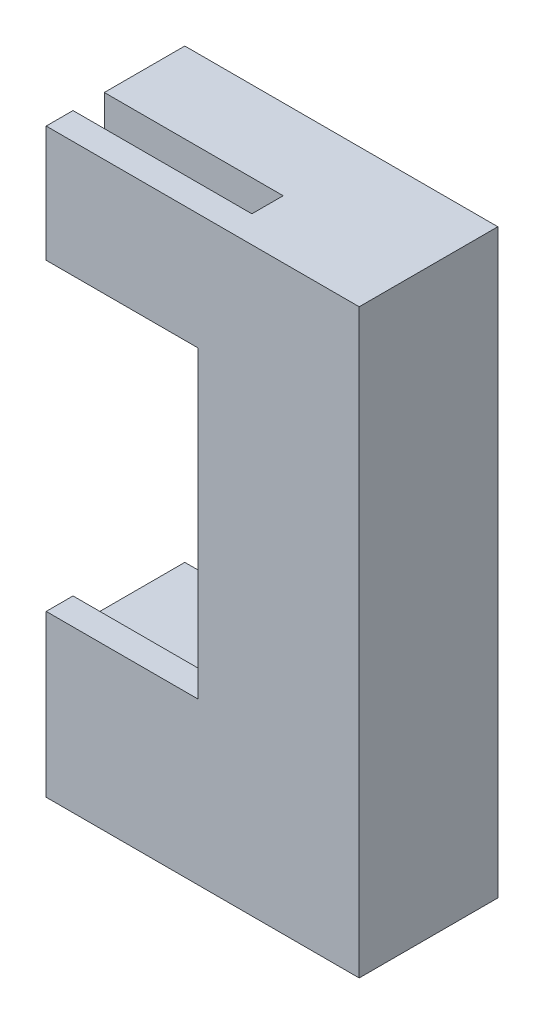
ISO-10303-21;
HEADER;
FILE_DESCRIPTION(('STEP AP214'),'2;1');
FILE_NAME('part.step','',(''),(''),'','','');
FILE_SCHEMA(('AUTOMOTIVE_DESIGN { 1 0 10303 214 1 1 1 1 }'));
ENDSEC;
DATA;
#1=APPLICATION_CONTEXT('core data for automotive mechanical design processes');
#2=APPLICATION_PROTOCOL_DEFINITION('international standard','automotive_design',2000,#1);
#3=PRODUCT_CONTEXT('',#1,'mechanical');
#4=PRODUCT('Part','Part','',(#3));
#5=PRODUCT_RELATED_PRODUCT_CATEGORY('part','',(#4));
#6=PRODUCT_DEFINITION_FORMATION('','',#4);
#7=PRODUCT_DEFINITION_CONTEXT('part definition',#1,'design');
#8=PRODUCT_DEFINITION('design','',#6,#7);
#9=PRODUCT_DEFINITION_SHAPE('','',#8);
#10=(LENGTH_UNIT() NAMED_UNIT(*) SI_UNIT(.MILLI.,.METRE.));
#11=(NAMED_UNIT(*) PLANE_ANGLE_UNIT() SI_UNIT($,.RADIAN.));
#12=(NAMED_UNIT(*) SI_UNIT($,.STERADIAN.) SOLID_ANGLE_UNIT());
#13=UNCERTAINTY_MEASURE_WITH_UNIT(LENGTH_MEASURE(1.E-05),#10,'distance_accuracy_value','');
#14=(GEOMETRIC_REPRESENTATION_CONTEXT(3) GLOBAL_UNCERTAINTY_ASSIGNED_CONTEXT((#13)) GLOBAL_UNIT_ASSIGNED_CONTEXT((#10,
#11,#12)) REPRESENTATION_CONTEXT('',''));
#15=CARTESIAN_POINT('',(0.,0.,0.));
#16=DIRECTION('',(0.,0.,1.));
#17=DIRECTION('',(1.,0.,0.));
#18=AXIS2_PLACEMENT_3D('',#15,#16,#17);
#19=CARTESIAN_POINT('',(-15.,55.,12.5));
#20=DIRECTION('',(1.,0.,0.));
#21=DIRECTION('',(0.,1.,0.));
#22=AXIS2_PLACEMENT_3D('',#19,#20,#21);
#23=PLANE('',#22);
#24=DIRECTION('',(0.,0.,1.));
#25=VECTOR('',#24,1.);
#26=CARTESIAN_POINT('',(-15.,51.1,0.));
#27=LINE('',#26,#25);
#28=CARTESIAN_POINT('',(-15.,51.1,0.));
#29=VERTEX_POINT('',#28);
#30=CARTESIAN_POINT('',(-15.,51.1,4.));
#31=VERTEX_POINT('',#30);
#32=EDGE_CURVE('E715',#29,#31,#27,.T.);
#33=ORIENTED_EDGE('',*,*,#32,.F.);
#34=DIRECTION('',(0.,-1.,0.));
#35=VECTOR('',#34,1.);
#36=CARTESIAN_POINT('',(-15.,55.,0.));
#37=LINE('',#36,#35);
#38=CARTESIAN_POINT('',(-15.,18.9,0.));
#39=VERTEX_POINT('',#38);
#40=EDGE_CURVE('E213',#29,#39,#37,.T.);
#41=ORIENTED_EDGE('',*,*,#40,.T.);
#42=DIRECTION('',(0.,0.,-1.));
#43=VECTOR('',#42,1.);
#44=CARTESIAN_POINT('',(-15.,18.9,0.));
#45=LINE('',#44,#43);
#46=CARTESIAN_POINT('',(-15.,18.9,4.));
#47=VERTEX_POINT('',#46);
#48=EDGE_CURVE('E231',#47,#39,#45,.T.);
#49=ORIENTED_EDGE('',*,*,#48,.F.);
#50=DIRECTION('',(0.,1.,0.));
#51=VECTOR('',#50,1.);
#52=CARTESIAN_POINT('',(-15.,18.9,4.));
#53=LINE('',#52,#51);
#54=CARTESIAN_POINT('',(-15.,16.7,4.));
#55=VERTEX_POINT('',#54);
#56=EDGE_CURVE('E220',#55,#47,#53,.T.);
#57=ORIENTED_EDGE('',*,*,#56,.F.);
#58=DIRECTION('',(0.,0.,1.));
#59=VECTOR('',#58,1.);
#60=CARTESIAN_POINT('',(-15.,16.7,0.));
#61=LINE('',#60,#59);
#62=CARTESIAN_POINT('',(-15.,16.7,0.));
#63=VERTEX_POINT('',#62);
#64=EDGE_CURVE('E215',#63,#55,#61,.T.);
#65=ORIENTED_EDGE('',*,*,#64,.F.);
#66=CARTESIAN_POINT('',(-15.,15.,0.));
#67=VERTEX_POINT('',#66);
#68=EDGE_CURVE('E382',#63,#67,#37,.T.);
#69=ORIENTED_EDGE('',*,*,#68,.T.);
#70=DIRECTION('',(0.,0.,-1.));
#71=VECTOR('',#70,1.);
#72=CARTESIAN_POINT('',(-15.,15.,12.5));
#73=LINE('',#72,#71);
#74=CARTESIAN_POINT('',(-15.,15.,12.5));
#75=VERTEX_POINT('',#74);
#76=EDGE_CURVE('E398',#75,#67,#73,.T.);
#77=ORIENTED_EDGE('',*,*,#76,.F.);
#78=DIRECTION('',(0.,-1.,0.));
#79=VECTOR('',#78,1.);
#80=CARTESIAN_POINT('',(-15.,55.,12.5));
#81=LINE('',#80,#79);
#82=CARTESIAN_POINT('',(-15.,65.,12.5));
#83=VERTEX_POINT('',#82);
#84=EDGE_CURVE('E354',#83,#75,#81,.T.);
#85=ORIENTED_EDGE('',*,*,#84,.F.);
#86=DIRECTION('',(0.,0.,-1.));
#87=VECTOR('',#86,1.);
#88=CARTESIAN_POINT('',(-15.,65.,9.));
#89=LINE('',#88,#87);
#90=CARTESIAN_POINT('',(-15.,65.,9.));
#91=VERTEX_POINT('',#90);
#92=EDGE_CURVE('E335',#83,#91,#89,.T.);
#93=ORIENTED_EDGE('',*,*,#92,.T.);
#94=DIRECTION('',(0.,1.,0.));
#95=VECTOR('',#94,1.);
#96=CARTESIAN_POINT('',(-15.,55.,9.));
#97=LINE('',#96,#95);
#98=CARTESIAN_POINT('',(-15.,55.,9.));
#99=VERTEX_POINT('',#98);
#100=EDGE_CURVE('E340',#99,#91,#97,.T.);
#101=ORIENTED_EDGE('',*,*,#100,.F.);
#102=DIRECTION('',(0.,0.,-1.));
#103=VECTOR('',#102,1.);
#104=CARTESIAN_POINT('',(-15.,55.,12.5));
#105=LINE('',#104,#103);
#106=CARTESIAN_POINT('',(-15.,55.,0.));
#107=VERTEX_POINT('',#106);
#108=EDGE_CURVE('E402',#99,#107,#105,.T.);
#109=ORIENTED_EDGE('',*,*,#108,.T.);
#110=CARTESIAN_POINT('',(-15.,53.3,0.));
#111=VERTEX_POINT('',#110);
#112=EDGE_CURVE('E383',#107,#111,#37,.T.);
#113=ORIENTED_EDGE('',*,*,#112,.T.);
#114=DIRECTION('',(0.,0.,-1.));
#115=VECTOR('',#114,1.);
#116=CARTESIAN_POINT('',(-15.,53.3,0.));
#117=LINE('',#116,#115);
#118=CARTESIAN_POINT('',(-15.,53.3,4.));
#119=VERTEX_POINT('',#118);
#120=EDGE_CURVE('E60',#119,#111,#117,.T.);
#121=ORIENTED_EDGE('',*,*,#120,.F.);
#122=DIRECTION('',(0.,1.,0.));
#123=VECTOR('',#122,1.);
#124=CARTESIAN_POINT('',(-15.,53.3,4.));
#125=LINE('',#124,#123);
#126=EDGE_CURVE('E55',#31,#119,#125,.T.);
#127=ORIENTED_EDGE('',*,*,#126,.F.);
#128=EDGE_LOOP('',(#33,#41,#49,#57,#65,#69,#77,#85,#93,#101,#109,#113,#121,#127));
#129=FACE_BOUND('',#128,.T.);
#130=ADVANCED_FACE('F39',(#129),#23,.F.);
#131=CARTESIAN_POINT('',(-35.,0.,12.5));
#132=DIRECTION('',(0.,1.,0.));
#133=DIRECTION('',(0.,0.,1.));
#134=AXIS2_PLACEMENT_3D('',#131,#132,#133);
#135=PLANE('',#134);
#136=DIRECTION('',(1.,0.,0.));
#137=VECTOR('',#136,1.);
#138=CARTESIAN_POINT('',(-35.,0.,0.));
#139=LINE('',#138,#137);
#140=CARTESIAN_POINT('',(-35.,0.,0.));
#141=VERTEX_POINT('',#140);
#142=CARTESIAN_POINT('',(0.,0.,0.));
#143=VERTEX_POINT('',#142);
#144=EDGE_CURVE('E351',#141,#143,#139,.T.);
#145=ORIENTED_EDGE('',*,*,#144,.T.);
#146=DIRECTION('',(0.,0.,-1.));
#147=VECTOR('',#146,1.);
#148=CARTESIAN_POINT('',(0.,0.,12.5));
#149=LINE('',#148,#147);
#150=CARTESIAN_POINT('',(0.,0.,15.5));
#151=VERTEX_POINT('',#150);
#152=EDGE_CURVE('E11',#151,#143,#149,.T.);
#153=ORIENTED_EDGE('',*,*,#152,.F.);
#154=DIRECTION('',(1.,0.,0.));
#155=VECTOR('',#154,1.);
#156=CARTESIAN_POINT('',(-35.,0.,15.5));
#157=LINE('',#156,#155);
#158=CARTESIAN_POINT('',(-35.,0.,15.5));
#159=VERTEX_POINT('',#158);
#160=EDGE_CURVE('E274',#159,#151,#157,.T.);
#161=ORIENTED_EDGE('',*,*,#160,.F.);
#162=DIRECTION('',(0.,0.,-1.));
#163=VECTOR('',#162,1.);
#164=CARTESIAN_POINT('',(-35.,0.,12.5));
#165=LINE('',#164,#163);
#166=EDGE_CURVE('E363',#159,#141,#165,.T.);
#167=ORIENTED_EDGE('',*,*,#166,.T.);
#168=EDGE_LOOP('',(#145,#153,#161,#167));
#169=FACE_BOUND('',#168,.T.);
#170=ADVANCED_FACE('F41',(#169),#135,.F.);
#171=CARTESIAN_POINT('',(0.,0.,12.5));
#172=DIRECTION('',(-1.,0.,0.));
#173=DIRECTION('',(0.,0.,1.));
#174=AXIS2_PLACEMENT_3D('',#171,#172,#173);
#175=PLANE('',#174);
#176=DIRECTION('',(0.,1.,0.));
#177=VECTOR('',#176,1.);
#178=CARTESIAN_POINT('',(0.,0.,0.));
#179=LINE('',#178,#177);
#180=CARTESIAN_POINT('',(0.,65.,0.));
#181=VERTEX_POINT('',#180);
#182=EDGE_CURVE('E367',#143,#181,#179,.T.);
#183=ORIENTED_EDGE('',*,*,#182,.T.);
#184=DIRECTION('',(0.,0.,-1.));
#185=VECTOR('',#184,1.);
#186=CARTESIAN_POINT('',(0.,65.,12.5));
#187=LINE('',#186,#185);
#188=CARTESIAN_POINT('',(0.,65.,15.5));
#189=VERTEX_POINT('',#188);
#190=EDGE_CURVE('E48',#189,#181,#187,.T.);
#191=ORIENTED_EDGE('',*,*,#190,.F.);
#192=DIRECTION('',(0.,1.,0.));
#193=VECTOR('',#192,1.);
#194=CARTESIAN_POINT('',(0.,0.,15.5));
#195=LINE('',#194,#193);
#196=EDGE_CURVE('E279',#151,#189,#195,.T.);
#197=ORIENTED_EDGE('',*,*,#196,.F.);
#198=ORIENTED_EDGE('',*,*,#152,.T.);
#199=EDGE_LOOP('',(#183,#191,#197,#198));
#200=FACE_BOUND('',#199,.T.);
#201=ADVANCED_FACE('F448',(#200),#175,.F.);
#202=CARTESIAN_POINT('',(0.,65.,12.5));
#203=DIRECTION('',(0.,-1.,0.));
#204=DIRECTION('',(0.,0.,-1.));
#205=AXIS2_PLACEMENT_3D('',#202,#203,#204);
#206=PLANE('',#205);
#207=DIRECTION('',(0.,0.,-1.));
#208=VECTOR('',#207,1.);
#209=CARTESIAN_POINT('',(-35.,65.,12.5));
#210=LINE('',#209,#208);
#211=CARTESIAN_POINT('',(-35.,65.,9.));
#212=VERTEX_POINT('',#211);
#213=CARTESIAN_POINT('',(-35.,65.,0.));
#214=VERTEX_POINT('',#213);
#215=EDGE_CURVE('E408',#212,#214,#210,.T.);
#216=ORIENTED_EDGE('',*,*,#215,.F.);
#217=DIRECTION('',(-1.,0.,0.));
#218=VECTOR('',#217,1.);
#219=CARTESIAN_POINT('',(-35.,65.,9.));
#220=LINE('',#219,#218);
#221=EDGE_CURVE('E341',#91,#212,#220,.T.);
#222=ORIENTED_EDGE('',*,*,#221,.F.);
#223=ORIENTED_EDGE('',*,*,#92,.F.);
#224=DIRECTION('',(-1.,0.,0.));
#225=VECTOR('',#224,1.);
#226=CARTESIAN_POINT('',(0.,65.,12.5));
#227=LINE('',#226,#225);
#228=CARTESIAN_POINT('',(-35.,65.,12.5));
#229=VERTEX_POINT('',#228);
#230=EDGE_CURVE('E302',#83,#229,#227,.T.);
#231=ORIENTED_EDGE('',*,*,#230,.T.);
#232=DIRECTION('',(0.,0.,-1.));
#233=VECTOR('',#232,1.);
#234=CARTESIAN_POINT('',(-35.,65.,15.5));
#235=LINE('',#234,#233);
#236=CARTESIAN_POINT('',(-35.,65.,15.5));
#237=VERTEX_POINT('',#236);
#238=EDGE_CURVE('E331',#237,#229,#235,.T.);
#239=ORIENTED_EDGE('',*,*,#238,.F.);
#240=DIRECTION('',(-1.,0.,0.));
#241=VECTOR('',#240,1.);
#242=CARTESIAN_POINT('',(0.,65.,15.5));
#243=LINE('',#242,#241);
#244=EDGE_CURVE('E283',#189,#237,#243,.T.);
#245=ORIENTED_EDGE('',*,*,#244,.F.);
#246=ORIENTED_EDGE('',*,*,#190,.T.);
#247=DIRECTION('',(-1.,0.,0.));
#248=VECTOR('',#247,1.);
#249=CARTESIAN_POINT('',(0.,65.,0.));
#250=LINE('',#249,#248);
#251=EDGE_CURVE('E370',#181,#214,#250,.T.);
#252=ORIENTED_EDGE('',*,*,#251,.T.);
#253=EDGE_LOOP('',(#216,#222,#223,#231,#239,#245,#246,#252));
#254=FACE_BOUND('',#253,.T.);
#255=ADVANCED_FACE('F416',(#254),#206,.F.);
#256=CARTESIAN_POINT('',(-35.,65.,12.5));
#257=DIRECTION('',(1.,0.,0.));
#258=DIRECTION('',(0.,0.,-1.));
#259=AXIS2_PLACEMENT_3D('',#256,#257,#258);
#260=PLANE('',#259);
#261=DIRECTION('',(0.,0.,-1.));
#262=VECTOR('',#261,1.);
#263=CARTESIAN_POINT('',(-35.,55.,12.5));
#264=LINE('',#263,#262);
#265=CARTESIAN_POINT('',(-35.,55.,9.));
#266=VERTEX_POINT('',#265);
#267=CARTESIAN_POINT('',(-35.,55.,0.));
#268=VERTEX_POINT('',#267);
#269=EDGE_CURVE('E405',#266,#268,#264,.T.);
#270=ORIENTED_EDGE('',*,*,#269,.F.);
#271=DIRECTION('',(0.,1.,0.));
#272=VECTOR('',#271,1.);
#273=CARTESIAN_POINT('',(-35.,55.,9.));
#274=LINE('',#273,#272);
#275=EDGE_CURVE('E347',#266,#212,#274,.T.);
#276=ORIENTED_EDGE('',*,*,#275,.T.);
#277=ORIENTED_EDGE('',*,*,#215,.T.);
#278=DIRECTION('',(0.,-1.,0.));
#279=VECTOR('',#278,1.);
#280=CARTESIAN_POINT('',(-35.,65.,0.));
#281=LINE('',#280,#279);
#282=EDGE_CURVE('E374',#214,#268,#281,.T.);
#283=ORIENTED_EDGE('',*,*,#282,.T.);
#284=EDGE_LOOP('',(#270,#276,#277,#283));
#285=FACE_BOUND('',#284,.T.);
#286=ADVANCED_FACE('F425',(#285),#260,.F.);
#287=CARTESIAN_POINT('',(-35.,55.,12.5));
#288=DIRECTION('',(0.,1.,0.));
#289=DIRECTION('',(0.,0.,1.));
#290=AXIS2_PLACEMENT_3D('',#287,#288,#289);
#291=PLANE('',#290);
#292=ORIENTED_EDGE('',*,*,#108,.F.);
#293=DIRECTION('',(-1.,0.,0.));
#294=VECTOR('',#293,1.);
#295=CARTESIAN_POINT('',(-35.,55.,9.));
#296=LINE('',#295,#294);
#297=EDGE_CURVE('E336',#99,#266,#296,.T.);
#298=ORIENTED_EDGE('',*,*,#297,.T.);
#299=ORIENTED_EDGE('',*,*,#269,.T.);
#300=DIRECTION('',(1.,0.,0.));
#301=VECTOR('',#300,1.);
#302=CARTESIAN_POINT('',(-35.,55.,0.));
#303=LINE('',#302,#301);
#304=EDGE_CURVE('E378',#268,#107,#303,.T.);
#305=ORIENTED_EDGE('',*,*,#304,.T.);
#306=EDGE_LOOP('',(#292,#298,#299,#305));
#307=FACE_BOUND('',#306,.T.);
#308=ADVANCED_FACE('F458',(#307),#291,.F.);
#309=CARTESIAN_POINT('',(-15.,15.,12.5));
#310=DIRECTION('',(0.,-1.,0.));
#311=DIRECTION('',(1.,0.,0.));
#312=AXIS2_PLACEMENT_3D('',#309,#310,#311);
#313=PLANE('',#312);
#314=DIRECTION('',(-1.,0.,0.));
#315=VECTOR('',#314,1.);
#316=CARTESIAN_POINT('',(-15.,15.,0.));
#317=LINE('',#316,#315);
#318=CARTESIAN_POINT('',(-35.,15.,0.));
#319=VERTEX_POINT('',#318);
#320=EDGE_CURVE('E386',#67,#319,#317,.T.);
#321=ORIENTED_EDGE('',*,*,#320,.T.);
#322=DIRECTION('',(0.,0.,-1.));
#323=VECTOR('',#322,1.);
#324=CARTESIAN_POINT('',(-35.,15.,12.5));
#325=LINE('',#324,#323);
#326=CARTESIAN_POINT('',(-35.,15.,12.5));
#327=VERTEX_POINT('',#326);
#328=EDGE_CURVE('E394',#327,#319,#325,.T.);
#329=ORIENTED_EDGE('',*,*,#328,.F.);
#330=DIRECTION('',(-1.,0.,0.));
#331=VECTOR('',#330,1.);
#332=CARTESIAN_POINT('',(-15.,15.,12.5));
#333=LINE('',#332,#331);
#334=EDGE_CURVE('E358',#75,#327,#333,.T.);
#335=ORIENTED_EDGE('',*,*,#334,.F.);
#336=ORIENTED_EDGE('',*,*,#76,.T.);
#337=EDGE_LOOP('',(#321,#329,#335,#336));
#338=FACE_BOUND('',#337,.T.);
#339=ADVANCED_FACE('F456',(#338),#313,.F.);
#340=CARTESIAN_POINT('',(-35.,15.,12.5));
#341=DIRECTION('',(1.,0.,0.));
#342=DIRECTION('',(0.,0.,-1.));
#343=AXIS2_PLACEMENT_3D('',#340,#341,#342);
#344=PLANE('',#343);
#345=CARTESIAN_POINT('',(-35.,10.,5.));
#346=DIRECTION('',(-1.,0.,0.));
#347=DIRECTION('',(0.,0.,1.));
#348=AXIS2_PLACEMENT_3D('',#345,#346,#347);
#349=CIRCLE('',#348,2.5);
#350=CARTESIAN_POINT('',(-35.,10.,7.5));
#351=VERTEX_POINT('',#350);
#352=EDGE_CURVE('E261',#351,#351,#349,.T.);
#353=ORIENTED_EDGE('',*,*,#352,.F.);
#354=EDGE_LOOP('',(#353));
#355=FACE_BOUND('',#354,.T.);
#356=DIRECTION('',(0.,-1.,0.));
#357=VECTOR('',#356,1.);
#358=CARTESIAN_POINT('',(-35.,15.,0.));
#359=LINE('',#358,#357);
#360=EDGE_CURVE('E359',#319,#141,#359,.T.);
#361=ORIENTED_EDGE('',*,*,#360,.T.);
#362=ORIENTED_EDGE('',*,*,#166,.F.);
#363=DIRECTION('',(0.,-1.,0.));
#364=VECTOR('',#363,1.);
#365=CARTESIAN_POINT('',(-35.,18.,15.5));
#366=LINE('',#365,#364);
#367=CARTESIAN_POINT('',(-35.,18.,15.5));
#368=VERTEX_POINT('',#367);
#369=EDGE_CURVE('E270',#368,#159,#366,.T.);
#370=ORIENTED_EDGE('',*,*,#369,.F.);
#371=DIRECTION('',(0.,0.,-1.));
#372=VECTOR('',#371,1.);
#373=CARTESIAN_POINT('',(-35.,18.,15.5));
#374=LINE('',#373,#372);
#375=CARTESIAN_POINT('',(-35.,18.,12.5));
#376=VERTEX_POINT('',#375);
#377=EDGE_CURVE('E298',#368,#376,#374,.T.);
#378=ORIENTED_EDGE('',*,*,#377,.T.);
#379=DIRECTION('',(0.,-1.,0.));
#380=VECTOR('',#379,1.);
#381=CARTESIAN_POINT('',(-35.,18.,12.5));
#382=LINE('',#381,#380);
#383=EDGE_CURVE('E266',#376,#327,#382,.T.);
#384=ORIENTED_EDGE('',*,*,#383,.T.);
#385=ORIENTED_EDGE('',*,*,#328,.T.);
#386=EDGE_LOOP('',(#361,#362,#370,#378,#384,#385));
#387=FACE_BOUND('',#386,.T.);
#388=ADVANCED_FACE('F453',(#355,#387),#344,.F.);
#389=CARTESIAN_POINT('',(0.,0.,0.));
#390=DIRECTION('',(0.,0.,1.));
#391=DIRECTION('',(1.,0.,0.));
#392=AXIS2_PLACEMENT_3D('',#389,#390,#391);
#393=PLANE('',#392);
#394=ORIENTED_EDGE('',*,*,#144,.F.);
#395=ORIENTED_EDGE('',*,*,#360,.F.);
#396=ORIENTED_EDGE('',*,*,#320,.F.);
#397=ORIENTED_EDGE('',*,*,#68,.F.);
#398=DIRECTION('',(1.,0.,0.));
#399=VECTOR('',#398,1.);
#400=CARTESIAN_POINT('',(-19.,16.7,0.));
#401=LINE('',#400,#399);
#402=CARTESIAN_POINT('',(-19.,16.7,0.));
#403=VERTEX_POINT('',#402);
#404=EDGE_CURVE('E257',#403,#63,#401,.T.);
#405=ORIENTED_EDGE('',*,*,#404,.F.);
#406=DIRECTION('',(0.,-1.,0.));
#407=VECTOR('',#406,1.);
#408=CARTESIAN_POINT('',(-19.,18.9,0.));
#409=LINE('',#408,#407);
#410=CARTESIAN_POINT('',(-19.,18.9,0.));
#411=VERTEX_POINT('',#410);
#412=EDGE_CURVE('E226',#411,#403,#409,.T.);
#413=ORIENTED_EDGE('',*,*,#412,.F.);
#414=DIRECTION('',(1.,0.,0.));
#415=VECTOR('',#414,1.);
#416=CARTESIAN_POINT('',(-19.,18.9,0.));
#417=LINE('',#416,#415);
#418=EDGE_CURVE('E239',#411,#39,#417,.T.);
#419=ORIENTED_EDGE('',*,*,#418,.T.);
#420=ORIENTED_EDGE('',*,*,#40,.F.);
#421=DIRECTION('',(1.,0.,0.));
#422=VECTOR('',#421,1.);
#423=CARTESIAN_POINT('',(-19.,51.1,0.));
#424=LINE('',#423,#422);
#425=CARTESIAN_POINT('',(-19.,51.1,0.));
#426=VERTEX_POINT('',#425);
#427=EDGE_CURVE('E192',#426,#29,#424,.T.);
#428=ORIENTED_EDGE('',*,*,#427,.F.);
#429=DIRECTION('',(0.,-1.,0.));
#430=VECTOR('',#429,1.);
#431=CARTESIAN_POINT('',(-19.,53.3,0.));
#432=LINE('',#431,#430);
#433=CARTESIAN_POINT('',(-19.,53.3,0.));
#434=VERTEX_POINT('',#433);
#435=EDGE_CURVE('E199',#434,#426,#432,.T.);
#436=ORIENTED_EDGE('',*,*,#435,.F.);
#437=DIRECTION('',(1.,0.,0.));
#438=VECTOR('',#437,1.);
#439=CARTESIAN_POINT('',(-19.,53.3,0.));
#440=LINE('',#439,#438);
#441=EDGE_CURVE('E703',#434,#111,#440,.T.);
#442=ORIENTED_EDGE('',*,*,#441,.T.);
#443=ORIENTED_EDGE('',*,*,#112,.F.);
#444=ORIENTED_EDGE('',*,*,#304,.F.);
#445=ORIENTED_EDGE('',*,*,#282,.F.);
#446=ORIENTED_EDGE('',*,*,#251,.F.);
#447=ORIENTED_EDGE('',*,*,#182,.F.);
#448=EDGE_LOOP('',(#394,#395,#396,#397,#405,#413,#419,#420,#428,#436,#442,#443,#444,#445,#446,#447));
#449=FACE_BOUND('',#448,.T.);
#450=ADVANCED_FACE('F211',(#449),#393,.F.);
#451=CARTESIAN_POINT('',(-35.,55.,9.));
#452=DIRECTION('',(0.,0.,-1.));
#453=DIRECTION('',(-1.,0.,0.));
#454=AXIS2_PLACEMENT_3D('',#451,#452,#453);
#455=PLANE('',#454);
#456=ORIENTED_EDGE('',*,*,#221,.T.);
#457=ORIENTED_EDGE('',*,*,#275,.F.);
#458=ORIENTED_EDGE('',*,*,#297,.F.);
#459=ORIENTED_EDGE('',*,*,#100,.T.);
#460=EDGE_LOOP('',(#456,#457,#458,#459));
#461=FACE_BOUND('',#460,.T.);
#462=ADVANCED_FACE('F430',(#461),#455,.F.);
#463=CARTESIAN_POINT('',(0.,0.,12.5));
#464=DIRECTION('',(0.,0.,1.));
#465=DIRECTION('',(1.,0.,0.));
#466=AXIS2_PLACEMENT_3D('',#463,#464,#465);
#467=PLANE('',#466);
#468=ORIENTED_EDGE('',*,*,#230,.F.);
#469=ORIENTED_EDGE('',*,*,#84,.T.);
#470=ORIENTED_EDGE('',*,*,#334,.T.);
#471=ORIENTED_EDGE('',*,*,#383,.F.);
#472=DIRECTION('',(-1.,0.,0.));
#473=VECTOR('',#472,1.);
#474=CARTESIAN_POINT('',(-18.,18.,12.5));
#475=LINE('',#474,#473);
#476=CARTESIAN_POINT('',(-18.,18.,12.5));
#477=VERTEX_POINT('',#476);
#478=EDGE_CURVE('E275',#477,#376,#475,.T.);
#479=ORIENTED_EDGE('',*,*,#478,.F.);
#480=DIRECTION('',(0.,-1.,0.));
#481=VECTOR('',#480,1.);
#482=CARTESIAN_POINT('',(-18.,52.,12.5));
#483=LINE('',#482,#481);
#484=CARTESIAN_POINT('',(-18.,52.,12.5));
#485=VERTEX_POINT('',#484);
#486=EDGE_CURVE('E311',#485,#477,#483,.T.);
#487=ORIENTED_EDGE('',*,*,#486,.F.);
#488=DIRECTION('',(1.,0.,0.));
#489=VECTOR('',#488,1.);
#490=CARTESIAN_POINT('',(-35.,52.,12.5));
#491=LINE('',#490,#489);
#492=CARTESIAN_POINT('',(-35.,52.,12.5));
#493=VERTEX_POINT('',#492);
#494=EDGE_CURVE('E308',#493,#485,#491,.T.);
#495=ORIENTED_EDGE('',*,*,#494,.F.);
#496=DIRECTION('',(0.,-1.,0.));
#497=VECTOR('',#496,1.);
#498=CARTESIAN_POINT('',(-35.,65.,12.5));
#499=LINE('',#498,#497);
#500=EDGE_CURVE('E305',#229,#493,#499,.T.);
#501=ORIENTED_EDGE('',*,*,#500,.F.);
#502=EDGE_LOOP('',(#468,#469,#470,#471,#479,#487,#495,#501));
#503=FACE_BOUND('',#502,.T.);
#504=ADVANCED_FACE('F435',(#503),#467,.F.);
#505=CARTESIAN_POINT('',(-35.,65.,15.5));
#506=DIRECTION('',(1.,0.,0.));
#507=DIRECTION('',(0.,0.,-1.));
#508=AXIS2_PLACEMENT_3D('',#505,#506,#507);
#509=PLANE('',#508);
#510=ORIENTED_EDGE('',*,*,#500,.T.);
#511=DIRECTION('',(0.,0.,-1.));
#512=VECTOR('',#511,1.);
#513=CARTESIAN_POINT('',(-35.,52.,15.5));
#514=LINE('',#513,#512);
#515=CARTESIAN_POINT('',(-35.,52.,15.5));
#516=VERTEX_POINT('',#515);
#517=EDGE_CURVE('E327',#516,#493,#514,.T.);
#518=ORIENTED_EDGE('',*,*,#517,.F.);
#519=DIRECTION('',(0.,-1.,0.));
#520=VECTOR('',#519,1.);
#521=CARTESIAN_POINT('',(-35.,65.,15.5));
#522=LINE('',#521,#520);
#523=EDGE_CURVE('E286',#237,#516,#522,.T.);
#524=ORIENTED_EDGE('',*,*,#523,.F.);
#525=ORIENTED_EDGE('',*,*,#238,.T.);
#526=EDGE_LOOP('',(#510,#518,#524,#525));
#527=FACE_BOUND('',#526,.T.);
#528=ADVANCED_FACE('F441',(#527),#509,.F.);
#529=CARTESIAN_POINT('',(-35.,52.,15.5));
#530=DIRECTION('',(0.,1.,0.));
#531=DIRECTION('',(0.,0.,1.));
#532=AXIS2_PLACEMENT_3D('',#529,#530,#531);
#533=PLANE('',#532);
#534=ORIENTED_EDGE('',*,*,#494,.T.);
#535=DIRECTION('',(0.,0.,-1.));
#536=VECTOR('',#535,1.);
#537=CARTESIAN_POINT('',(-18.,52.,15.5));
#538=LINE('',#537,#536);
#539=CARTESIAN_POINT('',(-18.,52.,15.5));
#540=VERTEX_POINT('',#539);
#541=EDGE_CURVE('E323',#540,#485,#538,.T.);
#542=ORIENTED_EDGE('',*,*,#541,.F.);
#543=DIRECTION('',(1.,0.,0.));
#544=VECTOR('',#543,1.);
#545=CARTESIAN_POINT('',(-35.,52.,15.5));
#546=LINE('',#545,#544);
#547=EDGE_CURVE('E289',#516,#540,#546,.T.);
#548=ORIENTED_EDGE('',*,*,#547,.F.);
#549=ORIENTED_EDGE('',*,*,#517,.T.);
#550=EDGE_LOOP('',(#534,#542,#548,#549));
#551=FACE_BOUND('',#550,.T.);
#552=ADVANCED_FACE('F549',(#551),#533,.F.);
#553=CARTESIAN_POINT('',(-18.,52.,15.5));
#554=DIRECTION('',(1.,0.,0.));
#555=DIRECTION('',(0.,0.,-1.));
#556=AXIS2_PLACEMENT_3D('',#553,#554,#555);
#557=PLANE('',#556);
#558=ORIENTED_EDGE('',*,*,#486,.T.);
#559=DIRECTION('',(0.,0.,-1.));
#560=VECTOR('',#559,1.);
#561=CARTESIAN_POINT('',(-18.,18.,15.5));
#562=LINE('',#561,#560);
#563=CARTESIAN_POINT('',(-18.,18.,15.5));
#564=VERTEX_POINT('',#563);
#565=EDGE_CURVE('E319',#564,#477,#562,.T.);
#566=ORIENTED_EDGE('',*,*,#565,.F.);
#567=DIRECTION('',(0.,-1.,0.));
#568=VECTOR('',#567,1.);
#569=CARTESIAN_POINT('',(-18.,52.,15.5));
#570=LINE('',#569,#568);
#571=EDGE_CURVE('E292',#540,#564,#570,.T.);
#572=ORIENTED_EDGE('',*,*,#571,.F.);
#573=ORIENTED_EDGE('',*,*,#541,.T.);
#574=EDGE_LOOP('',(#558,#566,#572,#573));
#575=FACE_BOUND('',#574,.T.);
#576=ADVANCED_FACE('F557',(#575),#557,.F.);
#577=CARTESIAN_POINT('',(-18.,18.,15.5));
#578=DIRECTION('',(0.,-1.,0.));
#579=DIRECTION('',(1.,0.,0.));
#580=AXIS2_PLACEMENT_3D('',#577,#578,#579);
#581=PLANE('',#580);
#582=ORIENTED_EDGE('',*,*,#478,.T.);
#583=ORIENTED_EDGE('',*,*,#377,.F.);
#584=DIRECTION('',(-1.,0.,0.));
#585=VECTOR('',#584,1.);
#586=CARTESIAN_POINT('',(-18.,18.,15.5));
#587=LINE('',#586,#585);
#588=EDGE_CURVE('E295',#564,#368,#587,.T.);
#589=ORIENTED_EDGE('',*,*,#588,.F.);
#590=ORIENTED_EDGE('',*,*,#565,.T.);
#591=EDGE_LOOP('',(#582,#583,#589,#590));
#592=FACE_BOUND('',#591,.T.);
#593=ADVANCED_FACE('F566',(#592),#581,.F.);
#594=CARTESIAN_POINT('',(0.,0.,15.5));
#595=DIRECTION('',(0.,0.,1.));
#596=DIRECTION('',(1.,0.,0.));
#597=AXIS2_PLACEMENT_3D('',#594,#595,#596);
#598=PLANE('',#597);
#599=ORIENTED_EDGE('',*,*,#369,.T.);
#600=ORIENTED_EDGE('',*,*,#160,.T.);
#601=ORIENTED_EDGE('',*,*,#196,.T.);
#602=ORIENTED_EDGE('',*,*,#244,.T.);
#603=ORIENTED_EDGE('',*,*,#523,.T.);
#604=ORIENTED_EDGE('',*,*,#547,.T.);
#605=ORIENTED_EDGE('',*,*,#571,.T.);
#606=ORIENTED_EDGE('',*,*,#588,.T.);
#607=EDGE_LOOP('',(#599,#600,#601,#602,#603,#604,#605,#606));
#608=FACE_BOUND('',#607,.T.);
#609=ADVANCED_FACE('F445',(#608),#598,.T.);
#610=CARTESIAN_POINT('',(-30.,10.,5.));
#611=DIRECTION('',(-1.,0.,0.));
#612=DIRECTION('',(0.,0.,1.));
#613=AXIS2_PLACEMENT_3D('',#610,#611,#612);
#614=CYLINDRICAL_SURFACE('',#613,2.5);
#615=CARTESIAN_POINT('',(-30.,10.,5.));
#616=DIRECTION('',(-1.,0.,0.));
#617=DIRECTION('',(0.,0.,1.));
#618=AXIS2_PLACEMENT_3D('',#615,#616,#617);
#619=CIRCLE('',#618,2.5);
#620=CARTESIAN_POINT('',(-30.,10.,7.5));
#621=VERTEX_POINT('',#620);
#622=EDGE_CURVE('E262',#621,#621,#619,.T.);
#623=ORIENTED_EDGE('',*,*,#622,.F.);
#624=EDGE_LOOP('',(#623));
#625=FACE_BOUND('',#624,.T.);
#626=ORIENTED_EDGE('',*,*,#352,.T.);
#627=EDGE_LOOP('',(#626));
#628=FACE_BOUND('',#627,.T.);
#629=ADVANCED_FACE('F582',(#625,#628),#614,.F.);
#630=CARTESIAN_POINT('',(-30.,10.,5.));
#631=DIRECTION('',(-1.,0.,0.));
#632=DIRECTION('',(0.,0.,1.));
#633=AXIS2_PLACEMENT_3D('',#630,#631,#632);
#634=PLANE('',#633);
#635=ORIENTED_EDGE('',*,*,#622,.T.);
#636=EDGE_LOOP('',(#635));
#637=FACE_BOUND('',#636,.T.);
#638=ADVANCED_FACE('F589',(#637),#634,.T.);
#639=CARTESIAN_POINT('',(-19.,16.7,0.));
#640=DIRECTION('',(0.,1.,0.));
#641=DIRECTION('',(-1.,0.,0.));
#642=AXIS2_PLACEMENT_3D('',#639,#640,#641);
#643=PLANE('',#642);
#644=ORIENTED_EDGE('',*,*,#64,.T.);
#645=DIRECTION('',(1.,0.,0.));
#646=VECTOR('',#645,1.);
#647=CARTESIAN_POINT('',(-19.,16.7,4.));
#648=LINE('',#647,#646);
#649=CARTESIAN_POINT('',(-19.,16.7,4.));
#650=VERTEX_POINT('',#649);
#651=EDGE_CURVE('E253',#650,#55,#648,.T.);
#652=ORIENTED_EDGE('',*,*,#651,.F.);
#653=DIRECTION('',(0.,0.,1.));
#654=VECTOR('',#653,1.);
#655=CARTESIAN_POINT('',(-19.,16.7,0.));
#656=LINE('',#655,#654);
#657=EDGE_CURVE('E230',#403,#650,#656,.T.);
#658=ORIENTED_EDGE('',*,*,#657,.F.);
#659=ORIENTED_EDGE('',*,*,#404,.T.);
#660=EDGE_LOOP('',(#644,#652,#658,#659));
#661=FACE_BOUND('',#660,.T.);
#662=ADVANCED_FACE('F598',(#661),#643,.F.);
#663=CARTESIAN_POINT('',(-19.,18.9,4.));
#664=DIRECTION('',(0.,0.,-1.));
#665=DIRECTION('',(-1.,0.,0.));
#666=AXIS2_PLACEMENT_3D('',#663,#664,#665);
#667=PLANE('',#666);
#668=ORIENTED_EDGE('',*,*,#56,.T.);
#669=DIRECTION('',(1.,0.,0.));
#670=VECTOR('',#669,1.);
#671=CARTESIAN_POINT('',(-19.,18.9,4.));
#672=LINE('',#671,#670);
#673=CARTESIAN_POINT('',(-19.,18.9,4.));
#674=VERTEX_POINT('',#673);
#675=EDGE_CURVE('E249',#674,#47,#672,.T.);
#676=ORIENTED_EDGE('',*,*,#675,.F.);
#677=DIRECTION('',(0.,1.,0.));
#678=VECTOR('',#677,1.);
#679=CARTESIAN_POINT('',(-19.,18.9,4.));
#680=LINE('',#679,#678);
#681=EDGE_CURVE('E234',#650,#674,#680,.T.);
#682=ORIENTED_EDGE('',*,*,#681,.F.);
#683=ORIENTED_EDGE('',*,*,#651,.T.);
#684=EDGE_LOOP('',(#668,#676,#682,#683));
#685=FACE_BOUND('',#684,.T.);
#686=ADVANCED_FACE('F625',(#685),#667,.F.);
#687=CARTESIAN_POINT('',(-19.,18.9,0.));
#688=DIRECTION('',(0.,-1.,0.));
#689=DIRECTION('',(1.,0.,0.));
#690=AXIS2_PLACEMENT_3D('',#687,#688,#689);
#691=PLANE('',#690);
#692=ORIENTED_EDGE('',*,*,#48,.T.);
#693=ORIENTED_EDGE('',*,*,#418,.F.);
#694=DIRECTION('',(0.,0.,-1.));
#695=VECTOR('',#694,1.);
#696=CARTESIAN_POINT('',(-19.,18.9,0.));
#697=LINE('',#696,#695);
#698=EDGE_CURVE('E237',#674,#411,#697,.T.);
#699=ORIENTED_EDGE('',*,*,#698,.F.);
#700=ORIENTED_EDGE('',*,*,#675,.T.);
#701=EDGE_LOOP('',(#692,#693,#699,#700));
#702=FACE_BOUND('',#701,.T.);
#703=ADVANCED_FACE('F634',(#702),#691,.F.);
#704=CARTESIAN_POINT('',(-19.,0.,0.));
#705=DIRECTION('',(-1.,0.,0.));
#706=DIRECTION('',(0.,0.,1.));
#707=AXIS2_PLACEMENT_3D('',#704,#705,#706);
#708=PLANE('',#707);
#709=ORIENTED_EDGE('',*,*,#412,.T.);
#710=ORIENTED_EDGE('',*,*,#657,.T.);
#711=ORIENTED_EDGE('',*,*,#681,.T.);
#712=ORIENTED_EDGE('',*,*,#698,.T.);
#713=EDGE_LOOP('',(#709,#710,#711,#712));
#714=FACE_BOUND('',#713,.T.);
#715=ADVANCED_FACE('F643',(#714),#708,.T.);
#716=CARTESIAN_POINT('',(-19.,51.1,0.));
#717=DIRECTION('',(0.,1.,0.));
#718=DIRECTION('',(-1.,0.,0.));
#719=AXIS2_PLACEMENT_3D('',#716,#717,#718);
#720=PLANE('',#719);
#721=ORIENTED_EDGE('',*,*,#32,.T.);
#722=DIRECTION('',(1.,0.,0.));
#723=VECTOR('',#722,1.);
#724=CARTESIAN_POINT('',(-19.,51.1,4.));
#725=LINE('',#724,#723);
#726=CARTESIAN_POINT('',(-19.,51.1,4.));
#727=VERTEX_POINT('',#726);
#728=EDGE_CURVE('E194',#727,#31,#725,.T.);
#729=ORIENTED_EDGE('',*,*,#728,.F.);
#730=DIRECTION('',(0.,0.,1.));
#731=VECTOR('',#730,1.);
#732=CARTESIAN_POINT('',(-19.,51.1,0.));
#733=LINE('',#732,#731);
#734=EDGE_CURVE('E188',#426,#727,#733,.T.);
#735=ORIENTED_EDGE('',*,*,#734,.F.);
#736=ORIENTED_EDGE('',*,*,#427,.T.);
#737=EDGE_LOOP('',(#721,#729,#735,#736));
#738=FACE_BOUND('',#737,.T.);
#739=ADVANCED_FACE('F190',(#738),#720,.F.);
#740=CARTESIAN_POINT('',(-19.,53.3,4.));
#741=DIRECTION('',(0.,0.,-1.));
#742=DIRECTION('',(-1.,0.,0.));
#743=AXIS2_PLACEMENT_3D('',#740,#741,#742);
#744=PLANE('',#743);
#745=ORIENTED_EDGE('',*,*,#126,.T.);
#746=DIRECTION('',(1.,0.,0.));
#747=VECTOR('',#746,1.);
#748=CARTESIAN_POINT('',(-19.,53.3,4.));
#749=LINE('',#748,#747);
#750=CARTESIAN_POINT('',(-19.,53.3,4.));
#751=VERTEX_POINT('',#750);
#752=EDGE_CURVE('E222',#751,#119,#749,.T.);
#753=ORIENTED_EDGE('',*,*,#752,.F.);
#754=DIRECTION('',(0.,1.,0.));
#755=VECTOR('',#754,1.);
#756=CARTESIAN_POINT('',(-19.,53.3,4.));
#757=LINE('',#756,#755);
#758=EDGE_CURVE('E198',#727,#751,#757,.T.);
#759=ORIENTED_EDGE('',*,*,#758,.F.);
#760=ORIENTED_EDGE('',*,*,#728,.T.);
#761=EDGE_LOOP('',(#745,#753,#759,#760));
#762=FACE_BOUND('',#761,.T.);
#763=ADVANCED_FACE('F660',(#762),#744,.F.);
#764=CARTESIAN_POINT('',(-19.,53.3,0.));
#765=DIRECTION('',(0.,-1.,0.));
#766=DIRECTION('',(0.,0.,-1.));
#767=AXIS2_PLACEMENT_3D('',#764,#765,#766);
#768=PLANE('',#767);
#769=ORIENTED_EDGE('',*,*,#120,.T.);
#770=ORIENTED_EDGE('',*,*,#441,.F.);
#771=DIRECTION('',(0.,0.,-1.));
#772=VECTOR('',#771,1.);
#773=CARTESIAN_POINT('',(-19.,53.3,0.));
#774=LINE('',#773,#772);
#775=EDGE_CURVE('E204',#751,#434,#774,.T.);
#776=ORIENTED_EDGE('',*,*,#775,.F.);
#777=ORIENTED_EDGE('',*,*,#752,.T.);
#778=EDGE_LOOP('',(#769,#770,#776,#777));
#779=FACE_BOUND('',#778,.T.);
#780=ADVANCED_FACE('F668',(#779),#768,.F.);
#781=CARTESIAN_POINT('',(-19.,0.,0.));
#782=DIRECTION('',(-1.,0.,0.));
#783=DIRECTION('',(0.,0.,1.));
#784=AXIS2_PLACEMENT_3D('',#781,#782,#783);
#785=PLANE('',#784);
#786=ORIENTED_EDGE('',*,*,#435,.T.);
#787=ORIENTED_EDGE('',*,*,#734,.T.);
#788=ORIENTED_EDGE('',*,*,#758,.T.);
#789=ORIENTED_EDGE('',*,*,#775,.T.);
#790=EDGE_LOOP('',(#786,#787,#788,#789));
#791=FACE_BOUND('',#790,.T.);
#792=ADVANCED_FACE('F202',(#791),#785,.T.);
#793=CLOSED_SHELL('',(#130,#170,#201,#255,#286,#308,#339,#388,#450,#462,#504,#528,#552,#576,
#593,#609,#629,#638,#662,#686,#703,#715,#739,#763,#780,#792));
#794=MANIFOLD_SOLID_BREP('B2',#793);
#795=ADVANCED_BREP_SHAPE_REPRESENTATION('',(#18,#794),#14);
#796=SHAPE_DEFINITION_REPRESENTATION(#9,#795);
ENDSEC;
END-ISO-10303-21;
